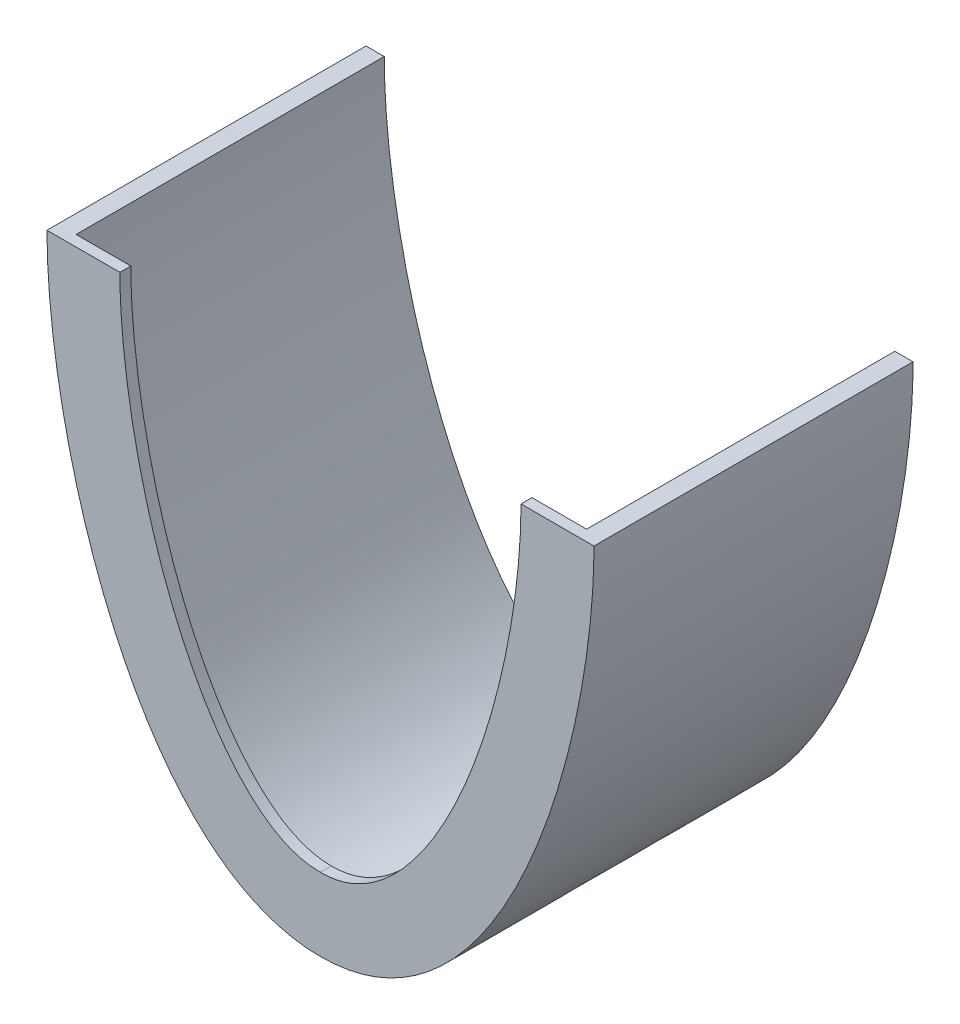
ISO-10303-21;
HEADER;
FILE_DESCRIPTION(('STEP AP214'),'2;1');
FILE_NAME('part.step','',(''),(''),'','','');
FILE_SCHEMA(('AUTOMOTIVE_DESIGN { 1 0 10303 214 1 1 1 1 }'));
ENDSEC;
DATA;
#1=APPLICATION_CONTEXT('core data for automotive mechanical design processes');
#2=APPLICATION_PROTOCOL_DEFINITION('international standard','automotive_design',2000,#1);
#3=PRODUCT_CONTEXT('',#1,'mechanical');
#4=PRODUCT('Part','Part','',(#3));
#5=PRODUCT_RELATED_PRODUCT_CATEGORY('part','',(#4));
#6=PRODUCT_DEFINITION_FORMATION('','',#4);
#7=PRODUCT_DEFINITION_CONTEXT('part definition',#1,'design');
#8=PRODUCT_DEFINITION('design','',#6,#7);
#9=PRODUCT_DEFINITION_SHAPE('','',#8);
#10=(LENGTH_UNIT() NAMED_UNIT(*) SI_UNIT(.MILLI.,.METRE.));
#11=(NAMED_UNIT(*) PLANE_ANGLE_UNIT() SI_UNIT($,.RADIAN.));
#12=(NAMED_UNIT(*) SI_UNIT($,.STERADIAN.) SOLID_ANGLE_UNIT());
#13=UNCERTAINTY_MEASURE_WITH_UNIT(LENGTH_MEASURE(1.E-05),#10,'distance_accuracy_value','');
#14=(GEOMETRIC_REPRESENTATION_CONTEXT(3) GLOBAL_UNCERTAINTY_ASSIGNED_CONTEXT((#13)) GLOBAL_UNIT_ASSIGNED_CONTEXT((#10,
#11,#12)) REPRESENTATION_CONTEXT('',''));
#15=CARTESIAN_POINT('',(0.,0.,0.));
#16=DIRECTION('',(0.,0.,1.));
#17=DIRECTION('',(1.,0.,0.));
#18=AXIS2_PLACEMENT_3D('',#15,#16,#17);
#19=CARTESIAN_POINT('',(0.,5.,-87.5));
#20=CARTESIAN_POINT('',(-0.686559974240621,5.,-87.5));
#21=CARTESIAN_POINT('',(-2.06788252931644,5.03678794060108,-87.5));
#22=CARTESIAN_POINT('',(-4.75909676519439,5.25359292247411,-87.5));
#23=CARTESIAN_POINT('',(-8.04410566241097,5.78641992998002,-87.5));
#24=CARTESIAN_POINT('',(-11.8610694544307,6.82776820991065,-87.5));
#25=CARTESIAN_POINT('',(-16.8064539932083,8.73541642424751,-87.5));
#26=CARTESIAN_POINT('',(-22.7389799185649,12.0686153557086,-87.5));
#27=CARTESIAN_POINT('',(-31.7156418042375,19.308664410868,-87.5));
#28=CARTESIAN_POINT('',(-41.8779553920237,31.6455886418494,-87.5));
#29=CARTESIAN_POINT('',(-52.0622405150787,50.4048717546784,-87.5));
#30=CARTESIAN_POINT('',(-58.7287802723183,68.1083225161614,-87.5));
#31=CARTESIAN_POINT('',(-62.9313824297874,82.7785156390204,-87.5));
#32=CARTESIAN_POINT('',(-65.5132158815167,93.8512363288701,-87.5));
#33=CARTESIAN_POINT('',(-67.5213414519886,104.810166668835,-87.5));
#34=CARTESIAN_POINT('',(-68.7152017445732,113.69415000205,-87.5));
#35=CARTESIAN_POINT('',(-69.3825002392556,120.558234940563,-87.5));
#36=CARTESIAN_POINT('',(-69.7392966767963,125.562483107459,-87.5));
#37=CARTESIAN_POINT('',(-69.9172023043414,129.587823738747,-87.5));
#38=CARTESIAN_POINT('',(-69.9881987731857,132.720199802312,-87.5));
#39=CARTESIAN_POINT('',(-69.9999999999943,134.235830660655,-87.5));
#40=CARTESIAN_POINT('',(-69.9999999999943,134.999999999995,-87.5));
#41=B_SPLINE_CURVE_WITH_KNOTS('',3,(#19,#20,#21,#22,#23,#24,#25,#26,#27,#28,#29,#30,#31,#32,#33,
#34,#35,#36,#37,#38,#39,#40),.UNSPECIFIED.,.F.,.F.,(4,1,1,1,1,1,1,1,1,1,1,1,1,1,1,1,1,1,1,4),
(0.,0.015625,0.03125,0.0625,0.09375,0.125,0.1875,0.25,0.375,0.5,0.625,0.6875,0.75,0.8125,0.875,
0.90625,0.9375,0.96875,0.984375,1.),.UNSPECIFIED.);
#42=DIRECTION('',(0.,0.,1.));
#43=VECTOR('',#42,1.);
#44=SURFACE_OF_LINEAR_EXTRUSION('',#41,#43);
#45=DIRECTION('',(0.,0.,1.));
#46=VECTOR('',#45,1.);
#47=CARTESIAN_POINT('',(-69.9999999999943,134.999999999995,-87.5));
#48=LINE('',#47,#46);
#49=CARTESIAN_POINT('',(-69.9999999999943,134.999999999995,-87.5));
#50=VERTEX_POINT('',#49);
#51=CARTESIAN_POINT('',(-69.9999999999943,134.999999999995,-3.));
#52=VERTEX_POINT('',#51);
#53=EDGE_CURVE('E44',#50,#52,#48,.T.);
#54=ORIENTED_EDGE('',*,*,#53,.T.);
#55=CARTESIAN_POINT('',(-69.9999999999943,134.999999999995,-3.));
#56=CARTESIAN_POINT('',(-70.0000430604235,134.5359953469,-3.));
#57=CARTESIAN_POINT('',(-69.9978197590453,134.071993005298,-3.));
#58=CARTESIAN_POINT('',(-69.9890648273813,133.144032198141,-3.));
#59=CARTESIAN_POINT('',(-69.9825332302922,132.680073732275,-3.));
#60=CARTESIAN_POINT('',(-69.9653864786516,131.752253501823,-3.));
#61=CARTESIAN_POINT('',(-69.9547715065297,131.288391733843,-3.));
#62=CARTESIAN_POINT('',(-69.92957971756,130.360776045232,-3.));
#63=CARTESIAN_POINT('',(-69.9150028909105,129.89702212487,-3.));
#64=CARTESIAN_POINT('',(-69.8655010574628,128.506350157881,-3.));
#65=CARTESIAN_POINT('',(-69.8247972986806,127.579631541247,-3.));
#66=CARTESIAN_POINT('',(-69.7289296073961,125.726946438725,-3.));
#67=CARTESIAN_POINT('',(-69.6737654810722,124.800979963085,-3.));
#68=CARTESIAN_POINT('',(-69.4877674185837,122.024399416097,-3.));
#69=CARTESIAN_POINT('',(-69.3364286357235,120.175126613472,-3.));
#70=CARTESIAN_POINT('',(-68.9834892389873,116.481052485306,-3.));
#71=CARTESIAN_POINT('',(-68.7818778337319,114.636252205783,-3.));
#72=CARTESIAN_POINT('',(-68.3315259686293,110.952021883338,-3.));
#73=CARTESIAN_POINT('',(-68.0827753894518,109.112593079755,-3.));
#74=CARTESIAN_POINT('',(-67.5402141724524,105.440170735066,-3.));
#75=CARTESIAN_POINT('',(-67.2463978418684,103.607178036942,-3.));
#76=CARTESIAN_POINT('',(-66.612235833262,99.932593427278,-3.));
#77=CARTESIAN_POINT('',(-66.271502196645,98.09106850858,-3.));
#78=CARTESIAN_POINT('',(-65.5461557562707,94.4165295831464,-3.));
#79=CARTESIAN_POINT('',(-65.1615394465715,92.5835162686253,-3.));
#80=CARTESIAN_POINT('',(-64.3485605352195,88.9272751609173,-3.));
#81=CARTESIAN_POINT('',(-63.920199339007,87.1040470553299,-3.));
#82=CARTESIAN_POINT('',(-63.0193595241522,83.4687763595573,-3.));
#83=CARTESIAN_POINT('',(-62.5468869017311,81.656732284685,-3.));
#84=CARTESIAN_POINT('',(-61.5569540519418,78.0453583558823,-3.));
#85=CARTESIAN_POINT('',(-61.0395029322672,76.2460260073742,-3.));
#86=CARTESIAN_POINT('',(-59.9581982996864,72.6617183064505,-3.));
#87=CARTESIAN_POINT('',(-59.3943540805907,70.8767401567642,-3.00000000000001));
#88=CARTESIAN_POINT('',(-58.3427541776611,67.6989192483238,-3.));
#89=CARTESIAN_POINT('',(-57.8641531125835,66.3030425392774,-3.));
#90=CARTESIAN_POINT('',(-56.8758276675117,63.522594929642,-3.));
#91=CARTESIAN_POINT('',(-56.3661085116936,62.1380221753273,-3.));
#92=CARTESIAN_POINT('',(-55.3141187692592,59.381369012985,-3.));
#93=CARTESIAN_POINT('',(-54.771849925589,58.0092879405853,-3.));
#94=CARTESIAN_POINT('',(-53.6530037629232,55.2789167989998,-3.));
#95=CARTESIAN_POINT('',(-53.0764211607206,53.9206288913988,-3.));
#96=CARTESIAN_POINT('',(-51.8877003000643,51.2214460074002,-3.));
#97=CARTESIAN_POINT('',(-51.2756015517605,49.8805336592694,-3.));
#98=CARTESIAN_POINT('',(-50.0130944647476,47.2167364462053,-3.));
#99=CARTESIAN_POINT('',(-49.362683864295,45.8938526512774,-3.));
#100=CARTESIAN_POINT('',(-48.0212951085247,43.2690532415441,-3.));
#101=CARTESIAN_POINT('',(-47.3303237481093,41.9671341609493,-3.));
#102=CARTESIAN_POINT('',(-45.9049770015057,39.3874811712891,-3.));
#103=CARTESIAN_POINT('',(-45.1706085286511,38.1097434526241,-3.00000000000001));
#104=CARTESIAN_POINT('',(-43.7126539748322,35.6782535738889,-3.00000000000001));
#105=CARTESIAN_POINT('',(-42.9924855291295,34.5224555117672,-3.));
#106=CARTESIAN_POINT('',(-41.5091835324472,32.2387341818841,-3.));
#107=CARTESIAN_POINT('',(-40.746051205863,31.1108101210794,-3.));
#108=CARTESIAN_POINT('',(-39.1736033046131,28.8871133684004,-3.));
#109=CARTESIAN_POINT('',(-38.3642762135384,27.79134879793,-3.));
#110=CARTESIAN_POINT('',(-36.6977956745603,25.6395213207554,-3.));
#111=CARTESIAN_POINT('',(-35.840721687713,24.5833970745927,-3.));
#112=CARTESIAN_POINT('',(-34.0742364760038,22.5159996452055,-3.));
#113=CARTESIAN_POINT('',(-33.1648339482191,21.5047190580877,-3.));
#114=CARTESIAN_POINT('',(-31.2903655569756,19.5357479226229,-3.));
#115=CARTESIAN_POINT('',(-30.3253252585928,18.578033153562,-3.00000000000001));
#116=CARTESIAN_POINT('',(-28.3881201295015,16.7750713482265,-3.00000000000001));
#117=CARTESIAN_POINT('',(-27.4190083994002,15.9265573856347,-3.));
#118=CARTESIAN_POINT('',(-25.4255702571227,14.2968771770219,-3.));
#119=CARTESIAN_POINT('',(-24.4012458029046,13.5157085453455,-3.));
#120=CARTESIAN_POINT('',(-22.2976031627468,12.0332686768629,-3.));
#121=CARTESIAN_POINT('',(-21.2183512106676,11.3319043644141,-3.));
#122=CARTESIAN_POINT('',(-19.5587333971145,10.3491827448884,-3.));
#123=CARTESIAN_POINT('',(-18.9987154466201,10.0331523326623,-3.));
#124=CARTESIAN_POINT('',(-17.865447319193,9.4258327898362,-3.));
#125=CARTESIAN_POINT('',(-17.2921985351751,9.13454106977127,-3.));
#126=CARTESIAN_POINT('',(-16.0588579711762,8.5427379294972,-3.00000000000001));
#127=CARTESIAN_POINT('',(-15.3970387854047,8.24581497163349,-3.));
#128=CARTESIAN_POINT('',(-14.0584497149913,7.68780812536982,-3.));
#129=CARTESIAN_POINT('',(-13.3816800743263,7.4267236526217,-3.));
#130=CARTESIAN_POINT('',(-12.0146593961961,6.94238468250346,-3.));
#131=CARTESIAN_POINT('',(-11.3244074255117,6.71913281425113,-3.));
#132=CARTESIAN_POINT('',(-9.93319928577737,6.31251243921084,-3.));
#133=CARTESIAN_POINT('',(-9.23225806552913,6.12909288041409,-3.));
#134=CARTESIAN_POINT('',(-7.8210042324012,5.8030510693503,-3.));
#135=CARTESIAN_POINT('',(-7.11069224675892,5.66042610082386,-3.));
#136=CARTESIAN_POINT('',(-5.6833306391581,5.41664920476586,-3.));
#137=CARTESIAN_POINT('',(-4.9662848113521,5.31547520600269,-3.00000000000001));
#138=CARTESIAN_POINT('',(-3.89434752495501,5.19559559361451,-3.));
#139=CARTESIAN_POINT('',(-3.54114695620252,5.16114006628776,-3.));
#140=CARTESIAN_POINT('',(-2.83391018170096,5.10223502059849,-3.));
#141=CARTESIAN_POINT('',(-2.47987401084235,5.0777850916354,-3.));
#142=CARTESIAN_POINT('',(-1.94863875454689,5.04856504983686,-3.));
#143=CARTESIAN_POINT('',(-1.77163500949743,5.04007033864058,-3.));
#144=CARTESIAN_POINT('',(-1.41753045828302,5.02551406593223,-3.));
#145=CARTESIAN_POINT('',(-1.24042965464808,5.0194524437608,-3.));
#146=CARTESIAN_POINT('',(-0.886125949928104,5.00974286792833,-3.));
#147=CARTESIAN_POINT('',(-0.708923035354744,5.00609540940628,-3.));
#148=CARTESIAN_POINT('',(-0.354480213652658,5.00122600464681,-3.));
#149=CARTESIAN_POINT('',(-0.177240305830305,5.00000410893089,-3.));
#150=CARTESIAN_POINT('',(0.,5.,-3.00000000000001));
#151=B_SPLINE_CURVE_WITH_KNOTS('',3,(#55,#56,#57,#58,#59,#60,#61,#62,#63,#64,#65,#66,#67,#68,
#69,#70,#71,#72,#73,#74,#75,#76,#77,#78,#79,#80,#81,#82,#83,#84,#85,#86,#87,#88,#89,#90,#91,#92,
#93,#94,#95,#96,#97,#98,#99,#100,#101,#102,#103,#104,#105,#106,#107,#108,#109,#110,#111,#112,
#113,#114,#115,#116,#117,#118,#119,#120,#121,#122,#123,#124,#125,#126,#127,#128,#129,#130,#131,
#132,#133,#134,#135,#136,#137,#138,#139,#140,#141,#142,#143,#144,#145,#146,#147,#148,#149,#150),
.UNSPECIFIED.,.F.,.F.,(4,2,2,2,2,2,2,2,2,2,2,2,2,2,2,2,2,2,2,2,2,2,2,2,2,2,2,2,2,2,2,2,2,2,2,2,
2,2,2,2,2,2,2,2,2,2,2,4),(0.,1.39200463259809,2.78399853949508,4.17593026462904,
5.56786543343828,8.35056461596665,11.1333010987038,16.6988412501919,22.2655771148554,
27.8335093429209,33.4021454993031,39.0199544631112,44.6382125682282,50.2562902260991,
55.8736053077277,61.4897855774717,67.1048434987348,71.5314416692052,75.9572987250754,
80.382918999546,84.8092224479582,89.2306928756655,93.6524245873574,98.073417655027,
102.493708329521,106.578259285234,110.662693897262,114.748151249225,118.82700163117,
122.905176049571,126.981491289855,130.843080578377,134.704533016872,138.561434659539,
140.490031906171,142.418427031934,144.593540452374,146.768618403275,148.943847445893,
151.116271882632,153.288551637376,155.459673219048,156.5241935372,157.588670166164,
158.120279422507,158.651875424469,159.183580421699,159.715296493581),.UNSPECIFIED.);
#152=CARTESIAN_POINT('',(0.,5.,-3.));
#153=VERTEX_POINT('',#152);
#154=EDGE_CURVE('E95',#52,#153,#151,.T.);
#155=ORIENTED_EDGE('',*,*,#154,.T.);
#156=DIRECTION('',(0.,0.,1.));
#157=VECTOR('',#156,1.);
#158=CARTESIAN_POINT('',(0.,5.,-87.5));
#159=LINE('',#158,#157);
#160=CARTESIAN_POINT('',(0.,5.,-87.5));
#161=VERTEX_POINT('',#160);
#162=EDGE_CURVE('E89',#161,#153,#159,.T.);
#163=ORIENTED_EDGE('',*,*,#162,.F.);
#164=EDGE_CURVE('E92',#161,#50,#41,.T.);
#165=ORIENTED_EDGE('',*,*,#164,.T.);
#166=EDGE_LOOP('',(#54,#155,#163,#165));
#167=FACE_BOUND('',#166,.T.);
#168=ADVANCED_FACE('F33',(#167),#44,.T.);
#169=CARTESIAN_POINT('',(69.9999999999943,134.999999999995,-87.5));
#170=CARTESIAN_POINT('',(69.9999999999943,134.235830660655,-87.5));
#171=CARTESIAN_POINT('',(69.9881987731857,132.720199802312,-87.5));
#172=CARTESIAN_POINT('',(69.9172023043414,129.587823738747,-87.5));
#173=CARTESIAN_POINT('',(69.7392966767963,125.562483107459,-87.5));
#174=CARTESIAN_POINT('',(69.3825002392556,120.558234940563,-87.5));
#175=CARTESIAN_POINT('',(68.7152017445732,113.69415000205,-87.5));
#176=CARTESIAN_POINT('',(67.5213414519886,104.810166668835,-87.5));
#177=CARTESIAN_POINT('',(65.5132158815167,93.8512363288701,-87.5));
#178=CARTESIAN_POINT('',(62.9313824297874,82.7785156390205,-87.5));
#179=CARTESIAN_POINT('',(58.7287802723183,68.1083225161615,-87.5));
#180=CARTESIAN_POINT('',(52.0622405150787,50.4048717546784,-87.5));
#181=CARTESIAN_POINT('',(41.8779553920237,31.6455886418494,-87.5));
#182=CARTESIAN_POINT('',(31.7156418042375,19.308664410868,-87.5));
#183=CARTESIAN_POINT('',(22.7389799185649,12.0686153557086,-87.5));
#184=CARTESIAN_POINT('',(16.8064539932083,8.73541642424751,-87.5));
#185=CARTESIAN_POINT('',(11.8610694544307,6.82776820991065,-87.5));
#186=CARTESIAN_POINT('',(8.04410566241097,5.78641992998002,-87.5));
#187=CARTESIAN_POINT('',(4.75909676519439,5.25359292247411,-87.5));
#188=CARTESIAN_POINT('',(2.06788252931644,5.03678794060108,-87.5));
#189=CARTESIAN_POINT('',(0.686559974240621,5.,-87.5));
#190=CARTESIAN_POINT('',(0.,5.,-87.5));
#191=B_SPLINE_CURVE_WITH_KNOTS('',3,(#169,#170,#171,#172,#173,#174,#175,#176,#177,#178,#179,
#180,#181,#182,#183,#184,#185,#186,#187,#188,#189,#190),.UNSPECIFIED.,.F.,.F.,(4,1,1,1,1,1,1,1,
1,1,1,1,1,1,1,1,1,1,1,4),(0.,0.015625,0.03125,0.0625,0.09375,0.125,0.1875,0.25,0.3125,0.375,0.5,
0.625,0.75,0.8125,0.875,0.90625,0.9375,0.96875,0.984375,1.),.UNSPECIFIED.);
#192=DIRECTION('',(0.,0.,1.));
#193=VECTOR('',#192,1.);
#194=SURFACE_OF_LINEAR_EXTRUSION('',#191,#193);
#195=ORIENTED_EDGE('',*,*,#162,.T.);
#196=CARTESIAN_POINT('',(0.,5.,-3.));
#197=CARTESIAN_POINT('',(0.276503172379767,5.00002733821382,-3.));
#198=CARTESIAN_POINT('',(0.553006036184891,5.00298586027732,-3.));
#199=CARTESIAN_POINT('',(1.10587382922783,5.01479879000536,-3.));
#200=CARTESIAN_POINT('',(1.38223876385953,5.0236529454862,-3.));
#201=CARTESIAN_POINT('',(1.93466755578556,5.04728853867322,-3.));
#202=CARTESIAN_POINT('',(2.21073145815662,5.06206891397106,-3.));
#203=CARTESIAN_POINT('',(2.76246192623856,5.0976876790481,-3.));
#204=CARTESIAN_POINT('',(3.03812849440939,5.11852603115849,-3.));
#205=CARTESIAN_POINT('',(3.86424235949402,5.19012745813669,-3.));
#206=CARTESIAN_POINT('',(4.41393065062802,5.2499822914747,-3.));
#207=CARTESIAN_POINT('',(5.51007469866058,5.39385464708246,-3.));
#208=CARTESIAN_POINT('',(6.05653069610877,5.47787034759326,-3.));
#209=CARTESIAN_POINT('',(7.1403502960892,5.66914375599728,-3.));
#210=CARTESIAN_POINT('',(7.67775153614074,5.77618795452154,-3.));
#211=CARTESIAN_POINT('',(8.74735334011617,6.0136662678066,-3.));
#212=CARTESIAN_POINT('',(9.27955393686282,6.14410023484719,-3.));
#213=CARTESIAN_POINT('',(10.3378032485226,6.42790924169852,-3.));
#214=CARTESIAN_POINT('',(10.8638519403926,6.58128436741007,-3.));
#215=CARTESIAN_POINT('',(11.9088981964989,6.91026366641136,-3.));
#216=CARTESIAN_POINT('',(12.427896183849,7.08586649922964,-3.));
#217=CARTESIAN_POINT('',(13.6290631385128,7.52039266355573,-3.00000000000001));
#218=CARTESIAN_POINT('',(14.308238776732,7.78763007568941,-3.));
#219=CARTESIAN_POINT('',(15.6512867389966,8.35810004952255,-3.));
#220=CARTESIAN_POINT('',(16.3151582705038,8.66133447038417,-3.));
#221=CARTESIAN_POINT('',(17.6264247374758,9.30144839136744,-3.));
#222=CARTESIAN_POINT('',(18.2738202278478,9.63832675648633,-3.));
#223=CARTESIAN_POINT('',(19.5524819062331,10.3439394327779,-3.));
#224=CARTESIAN_POINT('',(20.1837171639651,10.7127296609643,-3.));
#225=CARTESIAN_POINT('',(21.4283878686028,11.4791838931921,-3.));
#226=CARTESIAN_POINT('',(22.0418234329017,11.8768477067446,-3.));
#227=CARTESIAN_POINT('',(23.2506987857522,12.6986166328855,-3.));
#228=CARTESIAN_POINT('',(23.8461366940056,13.1227244941257,-3.));
#229=CARTESIAN_POINT('',(25.8994601206763,14.6499420668049,-3.00000000000001));
#230=CARTESIAN_POINT('',(27.3105994143976,15.8168736291664,-3.));
#231=CARTESIAN_POINT('',(29.3453041110991,17.6567810815394,-3.));
#232=CARTESIAN_POINT('',(30.0102009750895,18.2853574521424,-3.));
#233=CARTESIAN_POINT('',(31.3137487672081,19.5691679010509,-3.));
#234=CARTESIAN_POINT('',(31.9524024662064,20.224399150403,-3.));
#235=CARTESIAN_POINT('',(33.2064149397313,21.5604467245662,-3.));
#236=CARTESIAN_POINT('',(33.8216968745789,22.241334868712,-3.));
#237=CARTESIAN_POINT('',(35.0277625778055,23.6238852701016,-3.));
#238=CARTESIAN_POINT('',(35.6185577107981,24.3255376252869,-3.));
#239=CARTESIAN_POINT('',(36.7770630701109,25.747680430798,-3.));
#240=CARTESIAN_POINT('',(37.3447720808608,26.4681718697985,-3.));
#241=CARTESIAN_POINT('',(38.4581264935091,27.9260180180726,-3.));
#242=CARTESIAN_POINT('',(39.0037709114894,28.6633734770666,-3.));
#243=CARTESIAN_POINT('',(40.3517574262091,30.5399687466825,-3.00000000000001));
#244=CARTESIAN_POINT('',(41.1403161605006,31.6891316685548,-3.));
#245=CARTESIAN_POINT('',(42.6721525521913,34.017669964199,-3.));
#246=CARTESIAN_POINT('',(43.4154150769751,35.1970552497988,-3.));
#247=CARTESIAN_POINT('',(44.860056307093,37.5819579671795,-3.));
#248=CARTESIAN_POINT('',(45.5614139129011,38.7874881536793,-3.));
#249=CARTESIAN_POINT('',(46.9248893110938,41.2209724655679,-3.));
#250=CARTESIAN_POINT('',(47.5869950460265,42.4489333312707,-3.));
#251=CARTESIAN_POINT('',(48.8741239215521,44.9238644851672,-3.));
#252=CARTESIAN_POINT('',(49.4991527106001,46.1708318412633,-3.));
#253=CARTESIAN_POINT('',(50.7168705960195,48.6867616955506,-3.));
#254=CARTESIAN_POINT('',(51.309416179844,49.9557935418991,-3.));
#255=CARTESIAN_POINT('',(52.4610017661181,52.5082804508819,-3.));
#256=CARTESIAN_POINT('',(53.0200562703777,53.7917289809234,-3.));
#257=CARTESIAN_POINT('',(54.1066383338402,56.3716799402271,-3.));
#258=CARTESIAN_POINT('',(54.6341701289987,57.66818058809,-3.));
#259=CARTESIAN_POINT('',(55.6593246694504,60.2730189613558,-3.));
#260=CARTESIAN_POINT('',(56.156945854372,61.5813573002162,-3.));
#261=CARTESIAN_POINT('',(57.123602401234,64.208758546346,-3.));
#262=CARTESIAN_POINT('',(57.5926333860263,65.5278230609261,-3.));
#263=CARTESIAN_POINT('',(58.6818099833465,68.6950551878999,-3.00000000000001));
#264=CARTESIAN_POINT('',(59.2890107293474,70.5476851594184,-3.));
#265=CARTESIAN_POINT('',(60.4523652089149,74.2692652152761,-3.));
#266=CARTESIAN_POINT('',(61.0085086944929,76.1382184938754,-3.));
#267=CARTESIAN_POINT('',(62.0715737159892,79.8905155621911,-3.));
#268=CARTESIAN_POINT('',(62.5784841024115,81.7738625078637,-3.));
#269=CARTESIAN_POINT('',(63.5442317113883,85.5531581893717,-3.));
#270=CARTESIAN_POINT('',(64.0030610415329,87.4491089399487,-3.));
#271=CARTESIAN_POINT('',(64.8732198640582,91.2519777867555,-3.));
#272=CARTESIAN_POINT('',(65.2845468892888,93.1588964472358,-3.));
#273=CARTESIAN_POINT('',(66.0596648184208,96.9822221847895,-3.));
#274=CARTESIAN_POINT('',(66.4234593092495,98.8986285345568,-3.));
#275=CARTESIAN_POINT('',(67.095991309873,102.700693285632,-3.));
#276=CARTESIAN_POINT('',(67.4057022356253,104.586179462626,-3.));
#277=CARTESIAN_POINT('',(67.9776139470202,108.364072289145,-3.));
#278=CARTESIAN_POINT('',(68.2398218141716,110.25647786418,-3.));
#279=CARTESIAN_POINT('',(68.7145934321533,114.047005528065,-3.));
#280=CARTESIAN_POINT('',(68.9271703873693,115.945125960031,-3.));
#281=CARTESIAN_POINT('',(69.2993961091994,119.746063033836,-3.));
#282=CARTESIAN_POINT('',(69.459060373516,121.648878135855,-3.));
#283=CARTESIAN_POINT('',(69.6553576861759,124.505896534786,-3.));
#284=CARTESIAN_POINT('',(69.7135883059868,125.458650640024,-3.));
#285=CARTESIAN_POINT('',(69.8148194419688,127.364971527427,-3.));
#286=CARTESIAN_POINT('',(69.8578201773575,128.318538297695,-3.));
#287=CARTESIAN_POINT('',(69.9101317783762,129.749475198346,-3.));
#288=CARTESIAN_POINT('',(69.9255389005678,130.226629177691,-3.));
#289=CARTESIAN_POINT('',(69.9521660630442,131.181054206765,-3.));
#290=CARTESIAN_POINT('',(69.9633861143206,131.658325256185,-3.));
#291=CARTESIAN_POINT('',(69.981515969371,132.612972615614,-3.));
#292=CARTESIAN_POINT('',(69.9884255668665,133.090348929567,-3.));
#293=CARTESIAN_POINT('',(69.9976899243368,134.04514929733,-3.));
#294=CARTESIAN_POINT('',(70.000044646803,134.5225733515,-3.));
#295=CARTESIAN_POINT('',(69.9999999999943,134.999999999995,-3.00000000000001));
#296=B_SPLINE_CURVE_WITH_KNOTS('',3,(#196,#197,#198,#199,#200,#201,#202,#203,#204,#205,#206,
#207,#208,#209,#210,#211,#212,#213,#214,#215,#216,#217,#218,#219,#220,#221,#222,#223,#224,#225,
#226,#227,#228,#229,#230,#231,#232,#233,#234,#235,#236,#237,#238,#239,#240,#241,#242,#243,#244,
#245,#246,#247,#248,#249,#250,#251,#252,#253,#254,#255,#256,#257,#258,#259,#260,#261,#262,#263,
#264,#265,#266,#267,#268,#269,#270,#271,#272,#273,#274,#275,#276,#277,#278,#279,#280,#281,#282,
#283,#284,#285,#286,#287,#288,#289,#290,#291,#292,#293,#294,#295),.UNSPECIFIED.,.F.,.F.,(4,2,2,
2,2,2,2,2,2,2,2,2,2,2,2,2,2,2,2,2,2,2,2,2,2,2,2,2,2,2,2,2,2,2,2,2,2,2,2,2,2,2,2,2,2,2,2,2,2,4),
(0.,0.829493511051572,1.65895154308013,2.48826094252006,3.31756518538237,4.97579315801495,
6.63389613099756,8.27724194598853,9.92057738264496,11.5639189727573,13.2071615061418,
15.3955986190236,17.5841488088318,19.7726251912439,21.9650171086619,24.1573945634386,
26.3500002798115,31.8331332090171,34.577599086275,37.3217744421117,40.0743042997795,
42.8255420343982,45.5769244448649,48.328429411704,52.5082686557911,56.6894967361976,
60.8728126645702,65.0574070421509,69.2413622754275,73.442517847255,77.6418409489866,
81.8405984795777,86.0395748604693,90.239192496609,96.0871639873209,101.936306702556,
107.786770961076,113.638194062313,119.489920935182,125.341205966334,131.072884575779,
136.803708032044,142.533005051427,148.260622519552,151.124123245359,153.987582752517,
155.419775862236,156.851965212207,158.284223094887,159.716492771923),.UNSPECIFIED.);
#297=CARTESIAN_POINT('',(69.9999999999943,134.999999999995,-3.));
#298=VERTEX_POINT('',#297);
#299=EDGE_CURVE('E160',#153,#298,#296,.T.);
#300=ORIENTED_EDGE('',*,*,#299,.T.);
#301=DIRECTION('',(0.,0.,1.));
#302=VECTOR('',#301,1.);
#303=CARTESIAN_POINT('',(69.9999999999943,134.999999999995,-87.5));
#304=LINE('',#303,#302);
#305=CARTESIAN_POINT('',(69.9999999999943,134.999999999995,-87.5));
#306=VERTEX_POINT('',#305);
#307=EDGE_CURVE('E99',#306,#298,#304,.T.);
#308=ORIENTED_EDGE('',*,*,#307,.F.);
#309=EDGE_CURVE('E105',#306,#161,#191,.T.);
#310=ORIENTED_EDGE('',*,*,#309,.T.);
#311=EDGE_LOOP('',(#195,#300,#308,#310));
#312=FACE_BOUND('',#311,.T.);
#313=ADVANCED_FACE('F109',(#312),#194,.T.);
#314=CARTESIAN_POINT('',(-74.9999999999943,134.999999999995,-87.5));
#315=CARTESIAN_POINT('',(-74.9999999999943,84.9999999999955,-87.5));
#316=CARTESIAN_POINT('',(-50.,0.,-87.5));
#317=CARTESIAN_POINT('',(0.,0.,-87.5));
#318=B_SPLINE_CURVE_WITH_KNOTS('',3,(#314,#315,#316,#317),.UNSPECIFIED.,.F.,.F.,(4,4),(0.,1.),.UNSPECIFIED.);
#319=DIRECTION('',(0.,0.,1.));
#320=VECTOR('',#319,1.);
#321=SURFACE_OF_LINEAR_EXTRUSION('',#318,#320);
#322=CARTESIAN_POINT('',(-74.9999999999943,134.999999999995,0.));
#323=CARTESIAN_POINT('',(-74.9999999999943,84.9999999999955,0.));
#324=CARTESIAN_POINT('',(-50.,0.,0.));
#325=CARTESIAN_POINT('',(0.,0.,0.));
#326=B_SPLINE_CURVE_WITH_KNOTS('',3,(#322,#323,#324,#325),.UNSPECIFIED.,.F.,.F.,(4,4),(0.,1.),.UNSPECIFIED.);
#327=CARTESIAN_POINT('',(-74.9999999999943,134.999999999995,0.));
#328=VERTEX_POINT('',#327);
#329=CARTESIAN_POINT('',(0.,0.,0.));
#330=VERTEX_POINT('',#329);
#331=EDGE_CURVE('E197',#328,#330,#326,.T.);
#332=ORIENTED_EDGE('',*,*,#331,.F.);
#333=DIRECTION('',(0.,0.,1.));
#334=VECTOR('',#333,1.);
#335=CARTESIAN_POINT('',(-74.9999999999943,134.999999999995,-87.5));
#336=LINE('',#335,#334);
#337=CARTESIAN_POINT('',(-74.9999999999943,134.999999999995,-87.5));
#338=VERTEX_POINT('',#337);
#339=EDGE_CURVE('E11',#338,#328,#336,.T.);
#340=ORIENTED_EDGE('',*,*,#339,.F.);
#341=CARTESIAN_POINT('',(0.,0.,-87.5));
#342=VERTEX_POINT('',#341);
#343=EDGE_CURVE('E140',#338,#342,#318,.T.);
#344=ORIENTED_EDGE('',*,*,#343,.T.);
#345=DIRECTION('',(0.,0.,1.));
#346=VECTOR('',#345,1.);
#347=CARTESIAN_POINT('',(0.,0.,-87.5));
#348=LINE('',#347,#346);
#349=EDGE_CURVE('E38',#342,#330,#348,.T.);
#350=ORIENTED_EDGE('',*,*,#349,.T.);
#351=EDGE_LOOP('',(#332,#340,#344,#350));
#352=FACE_BOUND('',#351,.T.);
#353=ADVANCED_FACE('F35',(#352),#321,.T.);
#354=CARTESIAN_POINT('',(-69.9999999999943,134.999999999995,-87.5));
#355=DIRECTION('',(0.,1.,0.));
#356=DIRECTION('',(0.,0.,1.));
#357=AXIS2_PLACEMENT_3D('',#354,#355,#356);
#358=PLANE('',#357);
#359=DIRECTION('',(-1.,0.,0.));
#360=VECTOR('',#359,1.);
#361=CARTESIAN_POINT('',(-69.9999999999943,134.999999999995,0.));
#362=LINE('',#361,#360);
#363=CARTESIAN_POINT('',(-54.9999999999943,134.999999999995,0.));
#364=VERTEX_POINT('',#363);
#365=EDGE_CURVE('E148',#364,#328,#362,.T.);
#366=ORIENTED_EDGE('',*,*,#365,.F.);
#367=DIRECTION('',(0.,0.,1.));
#368=VECTOR('',#367,1.);
#369=CARTESIAN_POINT('',(-54.9999999999943,134.999999999995,-3.));
#370=LINE('',#369,#368);
#371=CARTESIAN_POINT('',(-54.9999999999943,134.999999999995,-3.));
#372=VERTEX_POINT('',#371);
#373=EDGE_CURVE('E194',#372,#364,#370,.T.);
#374=ORIENTED_EDGE('',*,*,#373,.F.);
#375=DIRECTION('',(-1.,0.,0.));
#376=VECTOR('',#375,1.);
#377=CARTESIAN_POINT('',(-69.9999999999943,134.999999999995,-3.));
#378=LINE('',#377,#376);
#379=EDGE_CURVE('E159',#372,#52,#378,.T.);
#380=ORIENTED_EDGE('',*,*,#379,.T.);
#381=ORIENTED_EDGE('',*,*,#53,.F.);
#382=DIRECTION('',(-1.,0.,0.));
#383=VECTOR('',#382,1.);
#384=CARTESIAN_POINT('',(-69.9999999999943,134.999999999995,-87.5));
#385=LINE('',#384,#383);
#386=EDGE_CURVE('E107',#50,#338,#385,.T.);
#387=ORIENTED_EDGE('',*,*,#386,.T.);
#388=ORIENTED_EDGE('',*,*,#339,.T.);
#389=EDGE_LOOP('',(#366,#374,#380,#381,#387,#388));
#390=FACE_BOUND('',#389,.T.);
#391=ADVANCED_FACE('F134',(#390),#358,.T.);
#392=CARTESIAN_POINT('',(69.9999999999943,134.999999999995,-87.5));
#393=DIRECTION('',(0.,1.,0.));
#394=DIRECTION('',(0.,0.,1.));
#395=AXIS2_PLACEMENT_3D('',#392,#393,#394);
#396=PLANE('',#395);
#397=DIRECTION('',(-1.,0.,0.));
#398=VECTOR('',#397,1.);
#399=CARTESIAN_POINT('',(69.9999999999943,134.999999999995,0.));
#400=LINE('',#399,#398);
#401=CARTESIAN_POINT('',(74.9999999999943,134.999999999995,0.));
#402=VERTEX_POINT('',#401);
#403=CARTESIAN_POINT('',(54.9999999999943,134.999999999995,0.));
#404=VERTEX_POINT('',#403);
#405=EDGE_CURVE('E327',#402,#404,#400,.T.);
#406=ORIENTED_EDGE('',*,*,#405,.F.);
#407=DIRECTION('',(0.,0.,1.));
#408=VECTOR('',#407,1.);
#409=CARTESIAN_POINT('',(74.9999999999943,134.999999999995,-87.5));
#410=LINE('',#409,#408);
#411=CARTESIAN_POINT('',(74.9999999999943,134.999999999995,-87.5));
#412=VERTEX_POINT('',#411);
#413=EDGE_CURVE('E67',#412,#402,#410,.T.);
#414=ORIENTED_EDGE('',*,*,#413,.F.);
#415=DIRECTION('',(-1.,0.,0.));
#416=VECTOR('',#415,1.);
#417=CARTESIAN_POINT('',(69.9999999999943,134.999999999995,-87.5));
#418=LINE('',#417,#416);
#419=EDGE_CURVE('E111',#412,#306,#418,.T.);
#420=ORIENTED_EDGE('',*,*,#419,.T.);
#421=ORIENTED_EDGE('',*,*,#307,.T.);
#422=DIRECTION('',(-1.,0.,0.));
#423=VECTOR('',#422,1.);
#424=CARTESIAN_POINT('',(69.9999999999943,134.999999999995,-3.));
#425=LINE('',#424,#423);
#426=CARTESIAN_POINT('',(54.9999999999943,134.999999999995,-3.));
#427=VERTEX_POINT('',#426);
#428=EDGE_CURVE('E304',#298,#427,#425,.T.);
#429=ORIENTED_EDGE('',*,*,#428,.T.);
#430=DIRECTION('',(0.,0.,1.));
#431=VECTOR('',#430,1.);
#432=CARTESIAN_POINT('',(54.9999999999943,134.999999999995,-3.));
#433=LINE('',#432,#431);
#434=EDGE_CURVE('E158',#427,#404,#433,.T.);
#435=ORIENTED_EDGE('',*,*,#434,.T.);
#436=EDGE_LOOP('',(#406,#414,#420,#421,#429,#435));
#437=FACE_BOUND('',#436,.T.);
#438=ADVANCED_FACE('F131',(#437),#396,.T.);
#439=CARTESIAN_POINT('',(0.,0.,-87.5));
#440=CARTESIAN_POINT('',(50.,0.,-87.5));
#441=CARTESIAN_POINT('',(74.9999999999943,84.9999999999955,-87.5));
#442=CARTESIAN_POINT('',(74.9999999999943,134.999999999995,-87.5));
#443=B_SPLINE_CURVE_WITH_KNOTS('',3,(#439,#440,#441,#442),.UNSPECIFIED.,.F.,.F.,(4,4),(0.,1.),.UNSPECIFIED.);
#444=DIRECTION('',(0.,0.,1.));
#445=VECTOR('',#444,1.);
#446=SURFACE_OF_LINEAR_EXTRUSION('',#443,#445);
#447=CARTESIAN_POINT('',(0.,0.,0.));
#448=CARTESIAN_POINT('',(50.,0.,0.));
#449=CARTESIAN_POINT('',(74.9999999999943,84.9999999999955,0.));
#450=CARTESIAN_POINT('',(74.9999999999943,134.999999999995,0.));
#451=B_SPLINE_CURVE_WITH_KNOTS('',3,(#447,#448,#449,#450),.UNSPECIFIED.,.F.,.F.,(4,4),(0.,1.),.UNSPECIFIED.);
#452=EDGE_CURVE('E330',#330,#402,#451,.T.);
#453=ORIENTED_EDGE('',*,*,#452,.F.);
#454=ORIENTED_EDGE('',*,*,#349,.F.);
#455=EDGE_CURVE('E113',#342,#412,#443,.T.);
#456=ORIENTED_EDGE('',*,*,#455,.T.);
#457=ORIENTED_EDGE('',*,*,#413,.T.);
#458=EDGE_LOOP('',(#453,#454,#456,#457));
#459=FACE_BOUND('',#458,.T.);
#460=ADVANCED_FACE('F133',(#459),#446,.T.);
#461=CARTESIAN_POINT('',(-56.2499999999972,48.7499999999977,-87.5));
#462=DIRECTION('',(0.,0.,-1.));
#463=DIRECTION('',(-1.,0.,0.));
#464=AXIS2_PLACEMENT_3D('',#461,#462,#463);
#465=PLANE('',#464);
#466=ORIENTED_EDGE('',*,*,#343,.F.);
#467=ORIENTED_EDGE('',*,*,#386,.F.);
#468=ORIENTED_EDGE('',*,*,#164,.F.);
#469=ORIENTED_EDGE('',*,*,#309,.F.);
#470=ORIENTED_EDGE('',*,*,#419,.F.);
#471=ORIENTED_EDGE('',*,*,#455,.F.);
#472=EDGE_LOOP('',(#466,#467,#468,#469,#470,#471));
#473=FACE_BOUND('',#472,.T.);
#474=ADVANCED_FACE('F103',(#473),#465,.T.);
#475=CARTESIAN_POINT('',(-56.2499999999972,48.7499999999977,0.));
#476=DIRECTION('',(0.,0.,-1.));
#477=DIRECTION('',(-1.,0.,0.));
#478=AXIS2_PLACEMENT_3D('',#475,#476,#477);
#479=PLANE('',#478);
#480=CARTESIAN_POINT('',(0.,20.,0.));
#481=CARTESIAN_POINT('',(-0.420626517919554,20.,0.));
#482=CARTESIAN_POINT('',(-1.27273636257411,20.0228879720968,0.));
#483=CARTESIAN_POINT('',(-2.88654878763499,20.1533633168957,0.));
#484=CARTESIAN_POINT('',(-4.85834536554432,20.4727767292932,0.));
#485=CARTESIAN_POINT('',(-7.16022621460921,21.0998395186009,0.));
#486=CARTESIAN_POINT('',(-10.2440354557089,22.2856921782664,0.));
#487=CARTESIAN_POINT('',(-14.1983558084039,24.4851772930536,0.));
#488=CARTESIAN_POINT('',(-19.1530550274473,28.4516960984578,0.));
#489=CARTESIAN_POINT('',(-24.179034544446,33.8029502372801,0.));
#490=CARTESIAN_POINT('',(-30.746433553764,42.6485762524177,0.));
#491=CARTESIAN_POINT('',(-38.3272932053278,56.5397422699477,0.));
#492=CARTESIAN_POINT('',(-44.4855266358941,72.8635639596974,0.));
#493=CARTESIAN_POINT('',(-48.4051785338512,86.5435569036988,0.));
#494=CARTESIAN_POINT('',(-50.8224163289312,96.9089513271602,0.));
#495=CARTESIAN_POINT('',(-52.7025311139085,107.170269874381,0.));
#496=CARTESIAN_POINT('',(-53.8159136084651,115.460227935937,0.));
#497=CARTESIAN_POINT('',(-54.4342709164319,121.822920438399,0.));
#498=CARTESIAN_POINT('',(-54.7628935799055,126.435742077311,0.));
#499=CARTESIAN_POINT('',(-54.9251133137953,130.110337821462,0.));
#500=CARTESIAN_POINT('',(-54.9894427699812,132.953310214105,0.));
#501=CARTESIAN_POINT('',(-54.9999999999943,134.312563404039,0.));
#502=CARTESIAN_POINT('',(-54.9999999999943,134.999999999995,0.));
#503=B_SPLINE_CURVE_WITH_KNOTS('',3,(#480,#481,#482,#483,#484,#485,#486,#487,#488,#489,#490,
#491,#492,#493,#494,#495,#496,#497,#498,#499,#500,#501,#502),.UNSPECIFIED.,.F.,.F.,(4,1,1,1,1,1,
1,1,1,1,1,1,1,1,1,1,1,1,1,1,4),(0.,0.015625,0.03125,0.0625,0.09375,0.125,0.1875,0.25,0.3125,
0.375,0.5,0.625,0.6875,0.75,0.8125,0.875,0.90625,0.9375,0.96875,0.984375,1.),.UNSPECIFIED.);
#504=CARTESIAN_POINT('',(0.,20.,0.));
#505=VERTEX_POINT('',#504);
#506=EDGE_CURVE('E198',#505,#364,#503,.T.);
#507=ORIENTED_EDGE('',*,*,#506,.T.);
#508=ORIENTED_EDGE('',*,*,#365,.T.);
#509=ORIENTED_EDGE('',*,*,#331,.T.);
#510=ORIENTED_EDGE('',*,*,#452,.T.);
#511=ORIENTED_EDGE('',*,*,#405,.T.);
#512=CARTESIAN_POINT('',(54.9999999999943,134.999999999995,0.));
#513=CARTESIAN_POINT('',(54.9999999999943,134.312563404039,0.));
#514=CARTESIAN_POINT('',(54.9894427699812,132.953310214105,0.));
#515=CARTESIAN_POINT('',(54.9251133137953,130.110337821462,0.));
#516=CARTESIAN_POINT('',(54.7628935799055,126.435742077311,0.));
#517=CARTESIAN_POINT('',(54.4342709164319,121.822920438399,0.));
#518=CARTESIAN_POINT('',(53.8159136084651,115.460227935937,0.));
#519=CARTESIAN_POINT('',(52.7025311139085,107.170269874381,0.));
#520=CARTESIAN_POINT('',(50.8224163289312,96.9089513271602,0.));
#521=CARTESIAN_POINT('',(48.4051785338512,86.5435569036988,0.));
#522=CARTESIAN_POINT('',(44.4855266358941,72.8635639596974,0.));
#523=CARTESIAN_POINT('',(38.3272932053278,56.5397422699477,0.));
#524=CARTESIAN_POINT('',(30.746433553764,42.6485762524177,0.));
#525=CARTESIAN_POINT('',(24.179034544446,33.8029502372801,0.));
#526=CARTESIAN_POINT('',(19.1530550274473,28.4516960984578,0.));
#527=CARTESIAN_POINT('',(14.1983558084039,24.4851772930536,0.));
#528=CARTESIAN_POINT('',(10.2440354557089,22.2856921782664,0.));
#529=CARTESIAN_POINT('',(7.16022621460922,21.0998395186009,0.));
#530=CARTESIAN_POINT('',(4.85834536554432,20.4727767292932,0.));
#531=CARTESIAN_POINT('',(2.88654878763499,20.1533633168957,0.));
#532=CARTESIAN_POINT('',(1.27273636257411,20.0228879720968,0.));
#533=CARTESIAN_POINT('',(0.420626517919554,20.,0.));
#534=CARTESIAN_POINT('',(0.,20.,0.));
#535=B_SPLINE_CURVE_WITH_KNOTS('',3,(#512,#513,#514,#515,#516,#517,#518,#519,#520,#521,#522,
#523,#524,#525,#526,#527,#528,#529,#530,#531,#532,#533,#534),.UNSPECIFIED.,.F.,.F.,(4,1,1,1,1,1,
1,1,1,1,1,1,1,1,1,1,1,1,1,1,4),(0.,0.015625,0.03125,0.0625,0.09375,0.125,0.1875,0.25,0.3125,
0.375,0.5,0.625,0.6875,0.75,0.8125,0.875,0.90625,0.9375,0.96875,0.984375,1.),.UNSPECIFIED.);
#536=EDGE_CURVE('E203',#404,#505,#535,.T.);
#537=ORIENTED_EDGE('',*,*,#536,.T.);
#538=EDGE_LOOP('',(#507,#508,#509,#510,#511,#537));
#539=FACE_BOUND('',#538,.T.);
#540=ADVANCED_FACE('F231',(#539),#479,.F.);
#541=CARTESIAN_POINT('',(0.,20.,-3.));
#542=CARTESIAN_POINT('',(-0.420626517919554,20.,-3.));
#543=CARTESIAN_POINT('',(-1.27273636257411,20.0228879720968,-3.));
#544=CARTESIAN_POINT('',(-2.88654878763499,20.1533633168957,-3.));
#545=CARTESIAN_POINT('',(-4.85834536554432,20.4727767292932,-3.));
#546=CARTESIAN_POINT('',(-7.16022621460921,21.0998395186009,-3.));
#547=CARTESIAN_POINT('',(-10.2440354557089,22.2856921782664,-3.));
#548=CARTESIAN_POINT('',(-14.1983558084039,24.4851772930536,-3.));
#549=CARTESIAN_POINT('',(-19.1530550274473,28.4516960984578,-3.));
#550=CARTESIAN_POINT('',(-24.179034544446,33.8029502372801,-3.));
#551=CARTESIAN_POINT('',(-30.746433553764,42.6485762524177,-3.));
#552=CARTESIAN_POINT('',(-38.3272932053278,56.5397422699477,-3.));
#553=CARTESIAN_POINT('',(-44.4855266358941,72.8635639596974,-3.));
#554=CARTESIAN_POINT('',(-48.4051785338512,86.5435569036988,-3.));
#555=CARTESIAN_POINT('',(-50.8224163289312,96.9089513271602,-3.));
#556=CARTESIAN_POINT('',(-52.7025311139085,107.170269874381,-3.));
#557=CARTESIAN_POINT('',(-53.8159136084651,115.460227935937,-3.));
#558=CARTESIAN_POINT('',(-54.4342709164319,121.822920438399,-3.));
#559=CARTESIAN_POINT('',(-54.7628935799055,126.435742077311,-3.));
#560=CARTESIAN_POINT('',(-54.9251133137953,130.110337821462,-3.));
#561=CARTESIAN_POINT('',(-54.9894427699812,132.953310214105,-3.));
#562=CARTESIAN_POINT('',(-54.9999999999943,134.312563404039,-3.));
#563=CARTESIAN_POINT('',(-54.9999999999943,134.999999999995,-3.));
#564=B_SPLINE_CURVE_WITH_KNOTS('',3,(#541,#542,#543,#544,#545,#546,#547,#548,#549,#550,#551,
#552,#553,#554,#555,#556,#557,#558,#559,#560,#561,#562,#563),.UNSPECIFIED.,.F.,.F.,(4,1,1,1,1,1,
1,1,1,1,1,1,1,1,1,1,1,1,1,1,4),(0.,0.015625,0.03125,0.0625,0.09375,0.125,0.1875,0.25,0.3125,
0.375,0.5,0.625,0.6875,0.75,0.8125,0.875,0.90625,0.9375,0.96875,0.984375,1.),.UNSPECIFIED.);
#565=DIRECTION('',(0.,0.,1.));
#566=VECTOR('',#565,1.);
#567=SURFACE_OF_LINEAR_EXTRUSION('',#564,#566);
#568=ORIENTED_EDGE('',*,*,#506,.F.);
#569=DIRECTION('',(0.,0.,1.));
#570=VECTOR('',#569,1.);
#571=CARTESIAN_POINT('',(0.,20.,-3.));
#572=LINE('',#571,#570);
#573=CARTESIAN_POINT('',(0.,20.,-3.));
#574=VERTEX_POINT('',#573);
#575=EDGE_CURVE('E191',#574,#505,#572,.T.);
#576=ORIENTED_EDGE('',*,*,#575,.F.);
#577=EDGE_CURVE('E216',#574,#372,#564,.T.);
#578=ORIENTED_EDGE('',*,*,#577,.T.);
#579=ORIENTED_EDGE('',*,*,#373,.T.);
#580=EDGE_LOOP('',(#568,#576,#578,#579));
#581=FACE_BOUND('',#580,.T.);
#582=ADVANCED_FACE('F229',(#581),#567,.T.);
#583=CARTESIAN_POINT('',(54.9999999999943,134.999999999995,-3.));
#584=CARTESIAN_POINT('',(54.9999999999943,134.312563404039,-3.));
#585=CARTESIAN_POINT('',(54.9894427699812,132.953310214105,-3.));
#586=CARTESIAN_POINT('',(54.9251133137953,130.110337821462,-3.));
#587=CARTESIAN_POINT('',(54.7628935799055,126.435742077311,-3.));
#588=CARTESIAN_POINT('',(54.4342709164319,121.822920438399,-3.));
#589=CARTESIAN_POINT('',(53.8159136084651,115.460227935937,-3.));
#590=CARTESIAN_POINT('',(52.7025311139085,107.170269874381,-3.));
#591=CARTESIAN_POINT('',(50.8224163289312,96.9089513271602,-3.));
#592=CARTESIAN_POINT('',(48.4051785338512,86.5435569036988,-3.));
#593=CARTESIAN_POINT('',(44.4855266358941,72.8635639596974,-3.));
#594=CARTESIAN_POINT('',(38.3272932053278,56.5397422699477,-3.));
#595=CARTESIAN_POINT('',(30.746433553764,42.6485762524177,-3.));
#596=CARTESIAN_POINT('',(24.179034544446,33.8029502372801,-3.));
#597=CARTESIAN_POINT('',(19.1530550274473,28.4516960984578,-3.));
#598=CARTESIAN_POINT('',(14.1983558084039,24.4851772930536,-3.));
#599=CARTESIAN_POINT('',(10.2440354557089,22.2856921782664,-3.));
#600=CARTESIAN_POINT('',(7.16022621460922,21.0998395186009,-3.));
#601=CARTESIAN_POINT('',(4.85834536554432,20.4727767292932,-3.));
#602=CARTESIAN_POINT('',(2.88654878763499,20.1533633168957,-3.));
#603=CARTESIAN_POINT('',(1.27273636257411,20.0228879720968,-3.));
#604=CARTESIAN_POINT('',(0.420626517919554,20.,-3.));
#605=CARTESIAN_POINT('',(0.,20.,-3.));
#606=B_SPLINE_CURVE_WITH_KNOTS('',3,(#583,#584,#585,#586,#587,#588,#589,#590,#591,#592,#593,
#594,#595,#596,#597,#598,#599,#600,#601,#602,#603,#604,#605),.UNSPECIFIED.,.F.,.F.,(4,1,1,1,1,1,
1,1,1,1,1,1,1,1,1,1,1,1,1,1,4),(0.,0.015625,0.03125,0.0625,0.09375,0.125,0.1875,0.25,0.3125,
0.375,0.5,0.625,0.6875,0.75,0.8125,0.875,0.90625,0.9375,0.96875,0.984375,1.),.UNSPECIFIED.);
#607=DIRECTION('',(0.,0.,1.));
#608=VECTOR('',#607,1.);
#609=SURFACE_OF_LINEAR_EXTRUSION('',#606,#608);
#610=ORIENTED_EDGE('',*,*,#536,.F.);
#611=ORIENTED_EDGE('',*,*,#434,.F.);
#612=EDGE_CURVE('E221',#427,#574,#606,.T.);
#613=ORIENTED_EDGE('',*,*,#612,.T.);
#614=ORIENTED_EDGE('',*,*,#575,.T.);
#615=EDGE_LOOP('',(#610,#611,#613,#614));
#616=FACE_BOUND('',#615,.T.);
#617=ADVANCED_FACE('F172',(#616),#609,.T.);
#618=CARTESIAN_POINT('',(51.6981676126841,50.8190147215035,-3.));
#619=DIRECTION('',(0.,0.,1.));
#620=DIRECTION('',(1.,0.,0.));
#621=AXIS2_PLACEMENT_3D('',#618,#619,#620);
#622=PLANE('',#621);
#623=ORIENTED_EDGE('',*,*,#299,.F.);
#624=ORIENTED_EDGE('',*,*,#154,.F.);
#625=ORIENTED_EDGE('',*,*,#379,.F.);
#626=ORIENTED_EDGE('',*,*,#577,.F.);
#627=ORIENTED_EDGE('',*,*,#612,.F.);
#628=ORIENTED_EDGE('',*,*,#428,.F.);
#629=EDGE_LOOP('',(#623,#624,#625,#626,#627,#628));
#630=FACE_BOUND('',#629,.T.);
#631=ADVANCED_FACE('F166',(#630),#622,.F.);
#632=CLOSED_SHELL('',(#168,#313,#353,#391,#438,#460,#474,#540,#582,#617,#631));
#633=MANIFOLD_SOLID_BREP('B2',#632);
#634=ADVANCED_BREP_SHAPE_REPRESENTATION('',(#18,#633),#14);
#635=SHAPE_DEFINITION_REPRESENTATION(#9,#634);
ENDSEC;
END-ISO-10303-21;
